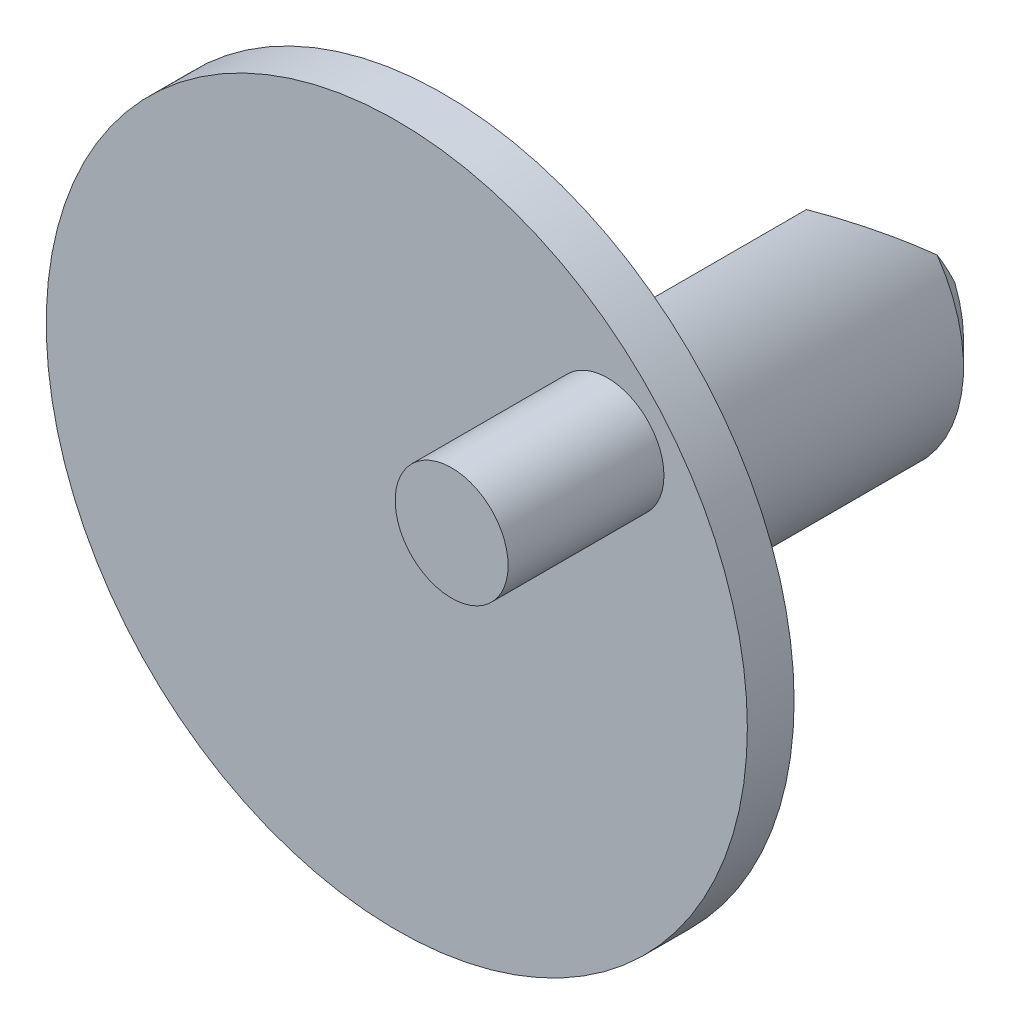
ISO-10303-21;
HEADER;
FILE_DESCRIPTION(('STEP AP214'),'2;1');
FILE_NAME('part.step','',(''),(''),'','','');
FILE_SCHEMA(('AUTOMOTIVE_DESIGN { 1 0 10303 214 1 1 1 1 }'));
ENDSEC;
DATA;
#1=APPLICATION_CONTEXT('core data for automotive mechanical design processes');
#2=APPLICATION_PROTOCOL_DEFINITION('international standard','automotive_design',2000,#1);
#3=PRODUCT_CONTEXT('',#1,'mechanical');
#4=PRODUCT('Part','Part','',(#3));
#5=PRODUCT_RELATED_PRODUCT_CATEGORY('part','',(#4));
#6=PRODUCT_DEFINITION_FORMATION('','',#4);
#7=PRODUCT_DEFINITION_CONTEXT('part definition',#1,'design');
#8=PRODUCT_DEFINITION('design','',#6,#7);
#9=PRODUCT_DEFINITION_SHAPE('','',#8);
#10=(LENGTH_UNIT() NAMED_UNIT(*) SI_UNIT(.MILLI.,.METRE.));
#11=(NAMED_UNIT(*) PLANE_ANGLE_UNIT() SI_UNIT($,.RADIAN.));
#12=(NAMED_UNIT(*) SI_UNIT($,.STERADIAN.) SOLID_ANGLE_UNIT());
#13=UNCERTAINTY_MEASURE_WITH_UNIT(LENGTH_MEASURE(1.E-05),#10,'distance_accuracy_value','');
#14=(GEOMETRIC_REPRESENTATION_CONTEXT(3) GLOBAL_UNCERTAINTY_ASSIGNED_CONTEXT((#13)) GLOBAL_UNIT_ASSIGNED_CONTEXT((#10,
#11,#12)) REPRESENTATION_CONTEXT('',''));
#15=CARTESIAN_POINT('',(0.,0.,0.));
#16=DIRECTION('',(0.,0.,1.));
#17=DIRECTION('',(1.,0.,0.));
#18=AXIS2_PLACEMENT_3D('',#15,#16,#17);
#19=CARTESIAN_POINT('',(0.,0.,-1.524));
#20=DIRECTION('',(0.,0.,1.));
#21=DIRECTION('',(1.,0.,0.));
#22=AXIS2_PLACEMENT_3D('',#19,#20,#21);
#23=PLANE('',#22);
#24=CARTESIAN_POINT('',(0.,0.,-1.524));
#25=DIRECTION('',(0.,0.,1.));
#26=DIRECTION('',(1.,0.,0.));
#27=AXIS2_PLACEMENT_3D('',#24,#25,#26);
#28=CIRCLE('',#27,11.43);
#29=CARTESIAN_POINT('',(11.43,0.,-1.524));
#30=VERTEX_POINT('',#29);
#31=EDGE_CURVE('E120',#30,#30,#28,.T.);
#32=ORIENTED_EDGE('',*,*,#31,.F.);
#33=EDGE_LOOP('',(#32));
#34=FACE_BOUND('',#33,.T.);
#35=CARTESIAN_POINT('',(0.,0.,-1.524));
#36=DIRECTION('',(0.,0.,-1.));
#37=DIRECTION('',(-1.,0.,0.));
#38=AXIS2_PLACEMENT_3D('',#35,#36,#37);
#39=CIRCLE('',#38,4.7625);
#40=CARTESIAN_POINT('',(2.05246798486637,4.29753201513364,-1.524));
#41=VERTEX_POINT('',#40);
#42=CARTESIAN_POINT('',(-4.29753201513365,-2.05246798486635,-1.524));
#43=VERTEX_POINT('',#42);
#44=EDGE_CURVE('E98',#41,#43,#39,.T.);
#45=ORIENTED_EDGE('',*,*,#44,.F.);
#46=DIRECTION('',(0.707106781186549,0.707106781186546,0.));
#47=VECTOR('',#46,1.);
#48=CARTESIAN_POINT('',(2.05246798486637,4.29753201513364,-1.524));
#49=LINE('',#48,#47);
#50=EDGE_CURVE('E105',#43,#41,#49,.T.);
#51=ORIENTED_EDGE('',*,*,#50,.F.);
#52=EDGE_LOOP('',(#45,#51));
#53=FACE_BOUND('',#52,.T.);
#54=ADVANCED_FACE('F45',(#34,#53),#23,.F.);
#55=CARTESIAN_POINT('',(0.,0.,-1.524));
#56=DIRECTION('',(0.,0.,1.));
#57=DIRECTION('',(1.,0.,0.));
#58=AXIS2_PLACEMENT_3D('',#55,#56,#57);
#59=CYLINDRICAL_SURFACE('',#58,11.43);
#60=ORIENTED_EDGE('',*,*,#31,.T.);
#61=EDGE_LOOP('',(#60));
#62=FACE_BOUND('',#61,.T.);
#63=CARTESIAN_POINT('',(0.,0.,0.));
#64=DIRECTION('',(0.,0.,1.));
#65=DIRECTION('',(1.,0.,0.));
#66=AXIS2_PLACEMENT_3D('',#63,#64,#65);
#67=CIRCLE('',#66,11.43);
#68=CARTESIAN_POINT('',(11.43,0.,0.));
#69=VERTEX_POINT('',#68);
#70=EDGE_CURVE('E119',#69,#69,#67,.T.);
#71=ORIENTED_EDGE('',*,*,#70,.F.);
#72=EDGE_LOOP('',(#71));
#73=FACE_BOUND('',#72,.T.);
#74=ADVANCED_FACE('F161',(#62,#73),#59,.T.);
#75=CARTESIAN_POINT('',(0.,0.,0.));
#76=DIRECTION('',(0.,0.,1.));
#77=DIRECTION('',(1.,0.,0.));
#78=AXIS2_PLACEMENT_3D('',#75,#76,#77);
#79=PLANE('',#78);
#80=CARTESIAN_POINT('',(6.86850768589337,5.76336226597146,0.));
#81=DIRECTION('',(0.,0.,1.));
#82=DIRECTION('',(1.,0.,0.));
#83=AXIS2_PLACEMENT_3D('',#80,#81,#82);
#84=CIRCLE('',#83,1.8415);
#85=CARTESIAN_POINT('',(8.71000768589337,5.76336226597146,0.));
#86=VERTEX_POINT('',#85);
#87=EDGE_CURVE('E192',#86,#86,#84,.T.);
#88=ORIENTED_EDGE('',*,*,#87,.F.);
#89=EDGE_LOOP('',(#88));
#90=FACE_BOUND('',#89,.T.);
#91=ORIENTED_EDGE('',*,*,#70,.T.);
#92=EDGE_LOOP('',(#91));
#93=FACE_BOUND('',#92,.T.);
#94=ADVANCED_FACE('F165',(#90,#93),#79,.T.);
#95=CARTESIAN_POINT('',(0.,0.,-14.478));
#96=DIRECTION('',(0.,0.,1.));
#97=DIRECTION('',(1.,0.,0.));
#98=AXIS2_PLACEMENT_3D('',#95,#96,#97);
#99=CYLINDRICAL_SURFACE('',#98,4.7625);
#100=CARTESIAN_POINT('',(0.,0.,-12.8905));
#101=DIRECTION('',(-0.5,0.500000000000002,-0.707106781186546));
#102=DIRECTION('',(-0.499999999999998,0.5,0.707106781186549));
#103=AXIS2_PLACEMENT_3D('',#100,#101,#102);
#104=ELLIPSE('',#103,6.73519209080188,4.7625);
#105=CARTESIAN_POINT('',(-4.29753201513365,-2.05246798486635,-11.303));
#106=VERTEX_POINT('',#105);
#107=CARTESIAN_POINT('',(-2.73290482585946,-3.90033812159844,-13.716));
#108=VERTEX_POINT('',#107);
#109=EDGE_CURVE('E131',#106,#108,#104,.F.);
#110=ORIENTED_EDGE('',*,*,#109,.T.);
#111=CARTESIAN_POINT('',(0.,0.,-13.716));
#112=DIRECTION('',(0.,0.,-1.));
#113=DIRECTION('',(-1.,0.,0.));
#114=AXIS2_PLACEMENT_3D('',#111,#112,#113);
#115=CIRCLE('',#114,4.7625);
#116=CARTESIAN_POINT('',(3.90033812159845,2.73290482585945,-13.716));
#117=VERTEX_POINT('',#116);
#118=EDGE_CURVE('E11',#108,#117,#115,.F.);
#119=ORIENTED_EDGE('',*,*,#118,.T.);
#120=CARTESIAN_POINT('',(0.,0.,-12.8905));
#121=DIRECTION('',(-0.5,0.500000000000002,-0.707106781186546));
#122=DIRECTION('',(-0.499999999999998,0.5,0.707106781186549));
#123=AXIS2_PLACEMENT_3D('',#120,#121,#122);
#124=ELLIPSE('',#123,6.73519209080188,4.7625);
#125=CARTESIAN_POINT('',(2.05246798486637,4.29753201513364,-11.303));
#126=VERTEX_POINT('',#125);
#127=EDGE_CURVE('E99',#117,#126,#124,.F.);
#128=ORIENTED_EDGE('',*,*,#127,.T.);
#129=DIRECTION('',(0.,0.,1.));
#130=VECTOR('',#129,1.);
#131=CARTESIAN_POINT('',(2.05246798486637,4.29753201513364,-14.478));
#132=LINE('',#131,#130);
#133=EDGE_CURVE('E94',#126,#41,#132,.T.);
#134=ORIENTED_EDGE('',*,*,#133,.T.);
#135=ORIENTED_EDGE('',*,*,#44,.T.);
#136=DIRECTION('',(0.,0.,1.));
#137=VECTOR('',#136,1.);
#138=CARTESIAN_POINT('',(-4.29753201513365,-2.05246798486635,-14.478));
#139=LINE('',#138,#137);
#140=EDGE_CURVE('E104',#106,#43,#139,.T.);
#141=ORIENTED_EDGE('',*,*,#140,.F.);
#142=EDGE_LOOP('',(#110,#119,#128,#134,#135,#141));
#143=FACE_BOUND('',#142,.T.);
#144=ADVANCED_FACE('F96',(#143),#99,.T.);
#145=CARTESIAN_POINT('',(2.05246798486637,4.29753201513364,-14.478));
#146=DIRECTION('',(0.707106781186546,-0.707106781186549,0.));
#147=DIRECTION('',(0.707106781186549,0.707106781186546,0.));
#148=AXIS2_PLACEMENT_3D('',#145,#146,#147);
#149=PLANE('',#148);
#150=ORIENTED_EDGE('',*,*,#133,.F.);
#151=DIRECTION('',(-0.707106781186549,-0.707106781186546,0.));
#152=VECTOR('',#151,1.);
#153=CARTESIAN_POINT('',(-4.29753201513365,-2.05246798486635,-11.303));
#154=LINE('',#153,#152);
#155=EDGE_CURVE('E136',#126,#106,#154,.T.);
#156=ORIENTED_EDGE('',*,*,#155,.T.);
#157=ORIENTED_EDGE('',*,*,#140,.T.);
#158=ORIENTED_EDGE('',*,*,#50,.T.);
#159=EDGE_LOOP('',(#150,#156,#157,#158));
#160=FACE_BOUND('',#159,.T.);
#161=ADVANCED_FACE('F112',(#160),#149,.F.);
#162=CARTESIAN_POINT('',(0.,0.,-14.478));
#163=DIRECTION('',(0.,0.,-1.));
#164=DIRECTION('',(-1.,0.,0.));
#165=AXIS2_PLACEMENT_3D('',#162,#163,#164);
#166=PLANE('',#165);
#167=DIRECTION('',(0.707106781186549,0.707106781186546,0.));
#168=VECTOR('',#167,1.);
#169=CARTESIAN_POINT('',(4.29753201513365,2.05246798486635,-14.478));
#170=LINE('',#169,#168);
#171=CARTESIAN_POINT('',(-1.4739891189995,-3.71905314926678,-14.478));
#172=VERTEX_POINT('',#171);
#173=CARTESIAN_POINT('',(3.71905314926678,1.47398911899948,-14.478));
#174=VERTEX_POINT('',#173);
#175=EDGE_CURVE('E124',#172,#174,#170,.T.);
#176=ORIENTED_EDGE('',*,*,#175,.T.);
#177=CARTESIAN_POINT('',(0.,0.,-14.478));
#178=DIRECTION('',(0.,0.,-1.));
#179=DIRECTION('',(-1.,0.,0.));
#180=AXIS2_PLACEMENT_3D('',#177,#178,#179);
#181=CIRCLE('',#180,4.0005);
#182=EDGE_CURVE('E139',#174,#172,#181,.T.);
#183=ORIENTED_EDGE('',*,*,#182,.T.);
#184=EDGE_LOOP('',(#176,#183));
#185=FACE_BOUND('',#184,.T.);
#186=ADVANCED_FACE('F160',(#185),#166,.T.);
#187=CARTESIAN_POINT('',(1.12253201513364,-1.12253201513365,-14.478));
#188=DIRECTION('',(-0.5,0.500000000000002,-0.707106781186546));
#189=DIRECTION('',(-0.707106781186549,-0.707106781186546,0.));
#190=AXIS2_PLACEMENT_3D('',#187,#188,#189);
#191=PLANE('',#190);
#192=ORIENTED_EDGE('',*,*,#175,.F.);
#193=CARTESIAN_POINT('',(-1.4739891189995,-3.71905314926678,-14.478));
#194=CARTESIAN_POINT('',(-1.58017606710346,-3.74101674326394,-14.4184450951768));
#195=CARTESIAN_POINT('',(-1.68608957960429,-3.76105713581246,-14.3577236297369));
#196=CARTESIAN_POINT('',(-1.89722157446992,-3.79759655345261,-14.2342680344359));
#197=CARTESIAN_POINT('',(-2.00244060779037,-3.814098827864,-14.1715358126064));
#198=CARTESIAN_POINT('',(-2.21220999574572,-3.84390330791118,-14.0442814058489));
#199=CARTESIAN_POINT('',(-2.31676048336583,-3.85720617054168,-13.9797595914516));
#200=CARTESIAN_POINT('',(-2.5252907023404,-3.88089722143535,-13.8490585622727));
#201=CARTESIAN_POINT('',(-2.62926981823106,-3.8912827097137,-13.7828778735122));
#202=CARTESIAN_POINT('',(-2.73290482585946,-3.90033812159844,-13.716));
#203=B_SPLINE_CURVE_WITH_KNOTS('',3,(#193,#194,#195,#196,#197,#198,#199,#200,#201,#202),
.UNSPECIFIED.,.F.,.F.,(4,2,2,2,4),(0.,0.371096679444427,0.741851079091665,1.11252927971728,
1.48354941545994),.UNSPECIFIED.);
#204=EDGE_CURVE('E56',#172,#108,#203,.T.);
#205=ORIENTED_EDGE('',*,*,#204,.T.);
#206=ORIENTED_EDGE('',*,*,#109,.F.);
#207=ORIENTED_EDGE('',*,*,#155,.F.);
#208=ORIENTED_EDGE('',*,*,#127,.F.);
#209=CARTESIAN_POINT('',(3.90033812159845,2.73290482585945,-13.716));
#210=CARTESIAN_POINT('',(3.89128270971371,2.62926981823104,-13.7828778735122));
#211=CARTESIAN_POINT('',(3.88089722143536,2.52529070234039,-13.8490585622727));
#212=CARTESIAN_POINT('',(3.85720617054169,2.31676048336582,-13.9797595914516));
#213=CARTESIAN_POINT('',(3.84390330791119,2.2122099957457,-14.0442814058489));
#214=CARTESIAN_POINT('',(3.814098827864,2.00244060779035,-14.1715358126064));
#215=CARTESIAN_POINT('',(3.79759655345262,1.8972215744699,-14.2342680344359));
#216=CARTESIAN_POINT('',(3.76105713581246,1.68608957960427,-14.3577236297369));
#217=CARTESIAN_POINT('',(3.74101674326395,1.58017606710345,-14.4184450951768));
#218=CARTESIAN_POINT('',(3.71905314926678,1.47398911899948,-14.478));
#219=B_SPLINE_CURVE_WITH_KNOTS('',3,(#209,#210,#211,#212,#213,#214,#215,#216,#217,#218),
.UNSPECIFIED.,.F.,.F.,(4,2,2,2,4),(0.,0.371020135742665,0.741698336368279,1.11245273601552,
1.48354941545994),.UNSPECIFIED.);
#220=EDGE_CURVE('E143',#117,#174,#219,.T.);
#221=ORIENTED_EDGE('',*,*,#220,.T.);
#222=EDGE_LOOP('',(#192,#205,#206,#207,#208,#221));
#223=FACE_BOUND('',#222,.T.);
#224=ADVANCED_FACE('F154',(#223),#191,.T.);
#225=CARTESIAN_POINT('',(0.,0.,-14.478));
#226=DIRECTION('',(0.,0.,1.));
#227=DIRECTION('',(1.,0.,0.));
#228=AXIS2_PLACEMENT_3D('',#225,#226,#227);
#229=CONICAL_SURFACE('',#228,4.0005,0.785398163397444);
#230=ORIENTED_EDGE('',*,*,#220,.F.);
#231=ORIENTED_EDGE('',*,*,#118,.F.);
#232=ORIENTED_EDGE('',*,*,#204,.F.);
#233=ORIENTED_EDGE('',*,*,#182,.F.);
#234=EDGE_LOOP('',(#230,#231,#232,#233));
#235=FACE_BOUND('',#234,.T.);
#236=ADVANCED_FACE('F48',(#235),#229,.T.);
#237=CARTESIAN_POINT('',(6.86850768589337,5.76336226597146,5.08));
#238=DIRECTION('',(0.,0.,-1.));
#239=DIRECTION('',(-1.,0.,0.));
#240=AXIS2_PLACEMENT_3D('',#237,#238,#239);
#241=CYLINDRICAL_SURFACE('',#240,1.8415);
#242=CARTESIAN_POINT('',(6.86850768589337,5.76336226597146,5.08));
#243=DIRECTION('',(0.,0.,1.));
#244=DIRECTION('',(1.,0.,0.));
#245=AXIS2_PLACEMENT_3D('',#242,#243,#244);
#246=CIRCLE('',#245,1.8415);
#247=CARTESIAN_POINT('',(8.71000768589337,5.76336226597146,5.08));
#248=VERTEX_POINT('',#247);
#249=EDGE_CURVE('E110',#248,#248,#246,.T.);
#250=ORIENTED_EDGE('',*,*,#249,.F.);
#251=EDGE_LOOP('',(#250));
#252=FACE_BOUND('',#251,.T.);
#253=ORIENTED_EDGE('',*,*,#87,.T.);
#254=EDGE_LOOP('',(#253));
#255=FACE_BOUND('',#254,.T.);
#256=ADVANCED_FACE('F180',(#252,#255),#241,.T.);
#257=CARTESIAN_POINT('',(6.86850768589337,5.76336226597146,5.08));
#258=DIRECTION('',(0.,0.,1.));
#259=DIRECTION('',(1.,0.,0.));
#260=AXIS2_PLACEMENT_3D('',#257,#258,#259);
#261=PLANE('',#260);
#262=ORIENTED_EDGE('',*,*,#249,.T.);
#263=EDGE_LOOP('',(#262));
#264=FACE_BOUND('',#263,.T.);
#265=ADVANCED_FACE('F183',(#264),#261,.T.);
#266=CLOSED_SHELL('',(#54,#74,#94,#144,#161,#186,#224,#236,#256,#265));
#267=MANIFOLD_SOLID_BREP('B2',#266);
#268=ADVANCED_BREP_SHAPE_REPRESENTATION('',(#18,#267),#14);
#269=SHAPE_DEFINITION_REPRESENTATION(#9,#268);
ENDSEC;
END-ISO-10303-21;
